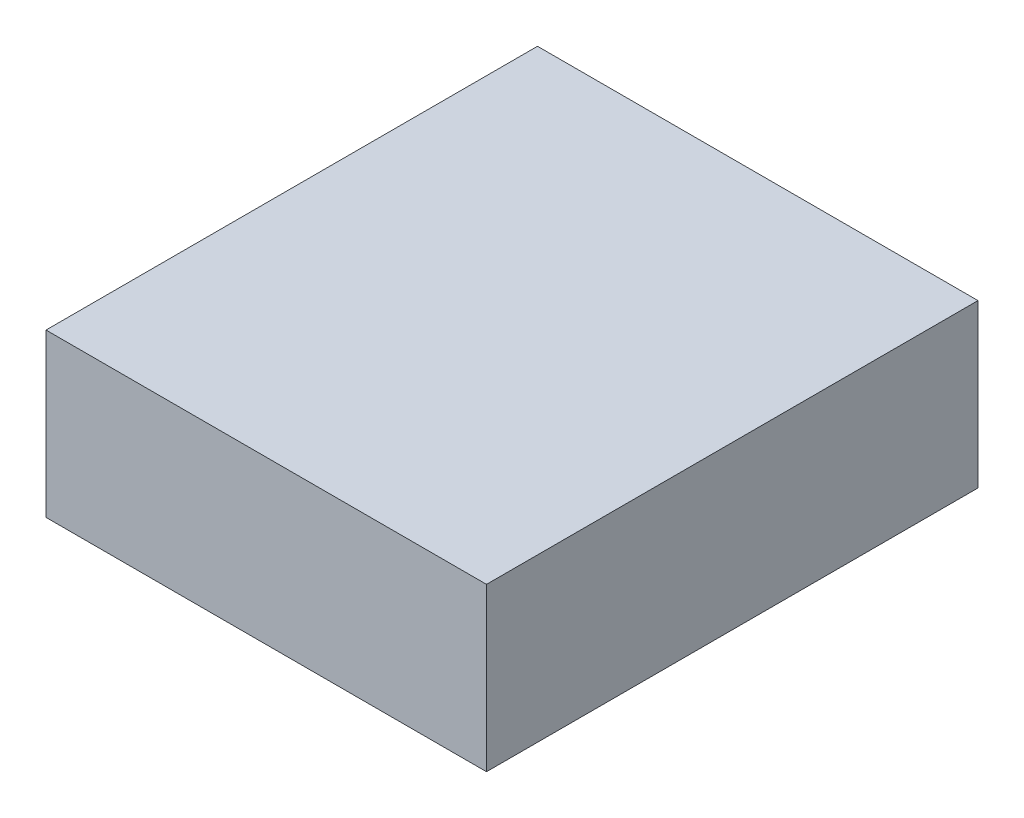
ISO-10303-21;
HEADER;
FILE_DESCRIPTION(('STEP AP214'),'2;1');
FILE_NAME('part.step','',(''),(''),'','','');
FILE_SCHEMA(('AUTOMOTIVE_DESIGN { 1 0 10303 214 1 1 1 1 }'));
ENDSEC;
DATA;
#1=APPLICATION_CONTEXT('core data for automotive mechanical design processes');
#2=APPLICATION_PROTOCOL_DEFINITION('international standard','automotive_design',2000,#1);
#3=PRODUCT_CONTEXT('',#1,'mechanical');
#4=PRODUCT('Part','Part','',(#3));
#5=PRODUCT_RELATED_PRODUCT_CATEGORY('part','',(#4));
#6=PRODUCT_DEFINITION_FORMATION('','',#4);
#7=PRODUCT_DEFINITION_CONTEXT('part definition',#1,'design');
#8=PRODUCT_DEFINITION('design','',#6,#7);
#9=PRODUCT_DEFINITION_SHAPE('','',#8);
#10=(LENGTH_UNIT() NAMED_UNIT(*) SI_UNIT(.MILLI.,.METRE.));
#11=(NAMED_UNIT(*) PLANE_ANGLE_UNIT() SI_UNIT($,.RADIAN.));
#12=(NAMED_UNIT(*) SI_UNIT($,.STERADIAN.) SOLID_ANGLE_UNIT());
#13=UNCERTAINTY_MEASURE_WITH_UNIT(LENGTH_MEASURE(1.E-05),#10,'distance_accuracy_value','');
#14=(GEOMETRIC_REPRESENTATION_CONTEXT(3) GLOBAL_UNCERTAINTY_ASSIGNED_CONTEXT((#13)) GLOBAL_UNIT_ASSIGNED_CONTEXT((#10,
#11,#12)) REPRESENTATION_CONTEXT('',''));
#15=CARTESIAN_POINT('',(0.,0.,0.));
#16=DIRECTION('',(0.,0.,1.));
#17=DIRECTION('',(1.,0.,0.));
#18=AXIS2_PLACEMENT_3D('',#15,#16,#17);
#19=CARTESIAN_POINT('',(-4.96766404188068,1.4,-2.86456115051007));
#20=DIRECTION('',(1.,0.,0.));
#21=DIRECTION('',(0.,0.,-1.));
#22=AXIS2_PLACEMENT_3D('',#19,#20,#21);
#23=PLANE('',#22);
#24=DIRECTION('',(0.,0.,1.));
#25=VECTOR('',#24,1.);
#26=CARTESIAN_POINT('',(-4.96766404188068,0.,-2.86456115051007));
#27=LINE('',#26,#25);
#28=CARTESIAN_POINT('',(-4.96766404188068,0.,-2.86456115051007));
#29=VERTEX_POINT('',#28);
#30=CARTESIAN_POINT('',(-4.96766404188068,0.,1.37543884948993));
#31=VERTEX_POINT('',#30);
#32=EDGE_CURVE('E107',#29,#31,#27,.T.);
#33=ORIENTED_EDGE('',*,*,#32,.T.);
#34=DIRECTION('',(0.,-1.,0.));
#35=VECTOR('',#34,1.);
#36=CARTESIAN_POINT('',(-4.96766404188068,1.4,1.37543884948993));
#37=LINE('',#36,#35);
#38=CARTESIAN_POINT('',(-4.96766404188068,1.4,1.37543884948993));
#39=VERTEX_POINT('',#38);
#40=EDGE_CURVE('E11',#39,#31,#37,.T.);
#41=ORIENTED_EDGE('',*,*,#40,.F.);
#42=DIRECTION('',(0.,0.,1.));
#43=VECTOR('',#42,1.);
#44=CARTESIAN_POINT('',(-4.96766404188068,1.4,-2.86456115051007));
#45=LINE('',#44,#43);
#46=CARTESIAN_POINT('',(-4.96766404188068,1.4,-2.86456115051007));
#47=VERTEX_POINT('',#46);
#48=EDGE_CURVE('E91',#47,#39,#45,.T.);
#49=ORIENTED_EDGE('',*,*,#48,.F.);
#50=DIRECTION('',(0.,-1.,0.));
#51=VECTOR('',#50,1.);
#52=CARTESIAN_POINT('',(-4.96766404188068,1.4,-2.86456115051007));
#53=LINE('',#52,#51);
#54=EDGE_CURVE('E103',#47,#29,#53,.T.);
#55=ORIENTED_EDGE('',*,*,#54,.T.);
#56=EDGE_LOOP('',(#33,#41,#49,#55));
#57=FACE_BOUND('',#56,.T.);
#58=ADVANCED_FACE('F39',(#57),#23,.F.);
#59=CARTESIAN_POINT('',(-4.96766404188068,1.4,1.37543884948993));
#60=DIRECTION('',(0.,0.,-1.));
#61=DIRECTION('',(-1.,0.,0.));
#62=AXIS2_PLACEMENT_3D('',#59,#60,#61);
#63=PLANE('',#62);
#64=DIRECTION('',(1.,0.,0.));
#65=VECTOR('',#64,1.);
#66=CARTESIAN_POINT('',(-4.96766404188068,0.,1.37543884948993));
#67=LINE('',#66,#65);
#68=CARTESIAN_POINT('',(-1.16766404188068,0.,1.37543884948993));
#69=VERTEX_POINT('',#68);
#70=EDGE_CURVE('E96',#31,#69,#67,.T.);
#71=ORIENTED_EDGE('',*,*,#70,.T.);
#72=DIRECTION('',(0.,-1.,0.));
#73=VECTOR('',#72,1.);
#74=CARTESIAN_POINT('',(-1.16766404188068,1.4,1.37543884948993));
#75=LINE('',#74,#73);
#76=CARTESIAN_POINT('',(-1.16766404188068,1.4,1.37543884948993));
#77=VERTEX_POINT('',#76);
#78=EDGE_CURVE('E48',#77,#69,#75,.T.);
#79=ORIENTED_EDGE('',*,*,#78,.F.);
#80=DIRECTION('',(1.,0.,0.));
#81=VECTOR('',#80,1.);
#82=CARTESIAN_POINT('',(-4.96766404188068,1.4,1.37543884948993));
#83=LINE('',#82,#81);
#84=EDGE_CURVE('E86',#39,#77,#83,.T.);
#85=ORIENTED_EDGE('',*,*,#84,.F.);
#86=ORIENTED_EDGE('',*,*,#40,.T.);
#87=EDGE_LOOP('',(#71,#79,#85,#86));
#88=FACE_BOUND('',#87,.T.);
#89=ADVANCED_FACE('F95',(#88),#63,.F.);
#90=CARTESIAN_POINT('',(-1.16766404188068,1.4,-2.86456115051007));
#91=DIRECTION('',(-1.,0.,0.));
#92=DIRECTION('',(0.,0.,1.));
#93=AXIS2_PLACEMENT_3D('',#90,#91,#92);
#94=PLANE('',#93);
#95=DIRECTION('',(0.,0.,-1.));
#96=VECTOR('',#95,1.);
#97=CARTESIAN_POINT('',(-1.16766404188068,0.,-2.86456115051007));
#98=LINE('',#97,#96);
#99=CARTESIAN_POINT('',(-1.16766404188068,0.,-2.86456115051007));
#100=VERTEX_POINT('',#99);
#101=EDGE_CURVE('E73',#69,#100,#98,.T.);
#102=ORIENTED_EDGE('',*,*,#101,.T.);
#103=DIRECTION('',(0.,-1.,0.));
#104=VECTOR('',#103,1.);
#105=CARTESIAN_POINT('',(-1.16766404188068,1.4,-2.86456115051007));
#106=LINE('',#105,#104);
#107=CARTESIAN_POINT('',(-1.16766404188068,1.4,-2.86456115051007));
#108=VERTEX_POINT('',#107);
#109=EDGE_CURVE('E98',#108,#100,#106,.T.);
#110=ORIENTED_EDGE('',*,*,#109,.F.);
#111=DIRECTION('',(0.,0.,-1.));
#112=VECTOR('',#111,1.);
#113=CARTESIAN_POINT('',(-1.16766404188068,1.4,-2.86456115051007));
#114=LINE('',#113,#112);
#115=EDGE_CURVE('E89',#77,#108,#114,.T.);
#116=ORIENTED_EDGE('',*,*,#115,.F.);
#117=ORIENTED_EDGE('',*,*,#78,.T.);
#118=EDGE_LOOP('',(#102,#110,#116,#117));
#119=FACE_BOUND('',#118,.T.);
#120=ADVANCED_FACE('F99',(#119),#94,.F.);
#121=CARTESIAN_POINT('',(-4.96766404188068,1.4,-2.86456115051007));
#122=DIRECTION('',(0.,0.,1.));
#123=DIRECTION('',(1.,0.,0.));
#124=AXIS2_PLACEMENT_3D('',#121,#122,#123);
#125=PLANE('',#124);
#126=DIRECTION('',(-1.,0.,0.));
#127=VECTOR('',#126,1.);
#128=CARTESIAN_POINT('',(-4.96766404188068,0.,-2.86456115051007));
#129=LINE('',#128,#127);
#130=EDGE_CURVE('E79',#100,#29,#129,.T.);
#131=ORIENTED_EDGE('',*,*,#130,.T.);
#132=ORIENTED_EDGE('',*,*,#54,.F.);
#133=DIRECTION('',(-1.,0.,0.));
#134=VECTOR('',#133,1.);
#135=CARTESIAN_POINT('',(-4.96766404188068,1.4,-2.86456115051007));
#136=LINE('',#135,#134);
#137=EDGE_CURVE('E56',#108,#47,#136,.T.);
#138=ORIENTED_EDGE('',*,*,#137,.F.);
#139=ORIENTED_EDGE('',*,*,#109,.T.);
#140=EDGE_LOOP('',(#131,#132,#138,#139));
#141=FACE_BOUND('',#140,.T.);
#142=ADVANCED_FACE('F120',(#141),#125,.F.);
#143=CARTESIAN_POINT('',(0.,1.4,0.));
#144=DIRECTION('',(0.,1.,0.));
#145=DIRECTION('',(0.,0.,1.));
#146=AXIS2_PLACEMENT_3D('',#143,#144,#145);
#147=PLANE('',#146);
#148=ORIENTED_EDGE('',*,*,#48,.T.);
#149=ORIENTED_EDGE('',*,*,#84,.T.);
#150=ORIENTED_EDGE('',*,*,#115,.T.);
#151=ORIENTED_EDGE('',*,*,#137,.T.);
#152=EDGE_LOOP('',(#148,#149,#150,#151));
#153=FACE_BOUND('',#152,.T.);
#154=ADVANCED_FACE('F87',(#153),#147,.T.);
#155=CARTESIAN_POINT('',(0.,0.,0.));
#156=DIRECTION('',(0.,1.,0.));
#157=DIRECTION('',(0.,0.,1.));
#158=AXIS2_PLACEMENT_3D('',#155,#156,#157);
#159=PLANE('',#158);
#160=ORIENTED_EDGE('',*,*,#32,.F.);
#161=ORIENTED_EDGE('',*,*,#130,.F.);
#162=ORIENTED_EDGE('',*,*,#101,.F.);
#163=ORIENTED_EDGE('',*,*,#70,.F.);
#164=EDGE_LOOP('',(#160,#161,#162,#163));
#165=FACE_BOUND('',#164,.T.);
#166=ADVANCED_FACE('F123',(#165),#159,.F.);
#167=CLOSED_SHELL('',(#58,#89,#120,#142,#154,#166));
#168=MANIFOLD_SOLID_BREP('B2',#167);
#169=ADVANCED_BREP_SHAPE_REPRESENTATION('',(#18,#168),#14);
#170=SHAPE_DEFINITION_REPRESENTATION(#9,#169);
ENDSEC;
END-ISO-10303-21;
